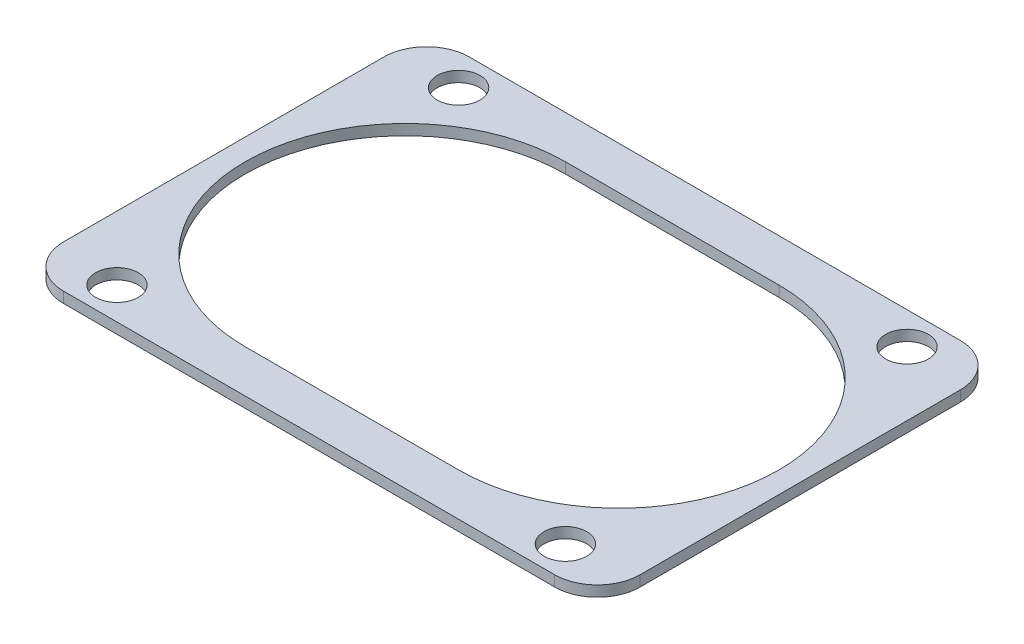
ISO-10303-21;
HEADER;
FILE_DESCRIPTION(('STEP AP214'),'2;1');
FILE_NAME('part.step','',(''),(''),'','','');
FILE_SCHEMA(('AUTOMOTIVE_DESIGN { 1 0 10303 214 1 1 1 1 }'));
ENDSEC;
DATA;
#1=APPLICATION_CONTEXT('core data for automotive mechanical design processes');
#2=APPLICATION_PROTOCOL_DEFINITION('international standard','automotive_design',2000,#1);
#3=PRODUCT_CONTEXT('',#1,'mechanical');
#4=PRODUCT('Part','Part','',(#3));
#5=PRODUCT_RELATED_PRODUCT_CATEGORY('part','',(#4));
#6=PRODUCT_DEFINITION_FORMATION('','',#4);
#7=PRODUCT_DEFINITION_CONTEXT('part definition',#1,'design');
#8=PRODUCT_DEFINITION('design','',#6,#7);
#9=PRODUCT_DEFINITION_SHAPE('','',#8);
#10=(LENGTH_UNIT() NAMED_UNIT(*) SI_UNIT(.MILLI.,.METRE.));
#11=(NAMED_UNIT(*) PLANE_ANGLE_UNIT() SI_UNIT($,.RADIAN.));
#12=(NAMED_UNIT(*) SI_UNIT($,.STERADIAN.) SOLID_ANGLE_UNIT());
#13=UNCERTAINTY_MEASURE_WITH_UNIT(LENGTH_MEASURE(1.E-05),#10,'distance_accuracy_value','');
#14=(GEOMETRIC_REPRESENTATION_CONTEXT(3) GLOBAL_UNCERTAINTY_ASSIGNED_CONTEXT((#13)) GLOBAL_UNIT_ASSIGNED_CONTEXT((#10,
#11,#12)) REPRESENTATION_CONTEXT('',''));
#15=CARTESIAN_POINT('',(0.,0.,0.));
#16=DIRECTION('',(0.,0.,1.));
#17=DIRECTION('',(1.,0.,0.));
#18=AXIS2_PLACEMENT_3D('',#15,#16,#17);
#19=CARTESIAN_POINT('',(0.,1.,0.));
#20=DIRECTION('',(0.,1.,0.));
#21=DIRECTION('',(0.,0.,1.));
#22=AXIS2_PLACEMENT_3D('',#19,#20,#21);
#23=PLANE('',#22);
#24=DIRECTION('',(1.,0.,0.));
#25=VECTOR('',#24,1.);
#26=CARTESIAN_POINT('',(10.,1.,15.));
#27=LINE('',#26,#25);
#28=CARTESIAN_POINT('',(10.,1.,15.));
#29=VERTEX_POINT('',#28);
#30=CARTESIAN_POINT('',(-10.,1.,15.));
#31=VERTEX_POINT('',#30);
#32=EDGE_CURVE('E128',#29,#31,#27,.F.);
#33=ORIENTED_EDGE('',*,*,#32,.T.);
#34=CARTESIAN_POINT('',(-10.,1.,0.));
#35=DIRECTION('',(0.,-1.,0.));
#36=DIRECTION('',(0.,0.,-1.));
#37=AXIS2_PLACEMENT_3D('',#34,#35,#36);
#38=CIRCLE('',#37,15.);
#39=CARTESIAN_POINT('',(-10.,1.,-15.));
#40=VERTEX_POINT('',#39);
#41=EDGE_CURVE('E180',#31,#40,#38,.T.);
#42=ORIENTED_EDGE('',*,*,#41,.T.);
#43=DIRECTION('',(-1.,0.,0.));
#44=VECTOR('',#43,1.);
#45=CARTESIAN_POINT('',(-10.,1.,-15.));
#46=LINE('',#45,#44);
#47=CARTESIAN_POINT('',(10.,1.,-15.));
#48=VERTEX_POINT('',#47);
#49=EDGE_CURVE('E132',#40,#48,#46,.F.);
#50=ORIENTED_EDGE('',*,*,#49,.T.);
#51=CARTESIAN_POINT('',(10.,1.,0.));
#52=DIRECTION('',(0.,-1.,0.));
#53=DIRECTION('',(0.,0.,-1.));
#54=AXIS2_PLACEMENT_3D('',#51,#52,#53);
#55=CIRCLE('',#54,15.);
#56=EDGE_CURVE('E178',#48,#29,#55,.T.);
#57=ORIENTED_EDGE('',*,*,#56,.T.);
#58=EDGE_LOOP('',(#33,#42,#50,#57));
#59=FACE_BOUND('',#58,.T.);
#60=CARTESIAN_POINT('',(-21.,1.,-16.));
#61=DIRECTION('',(0.,-1.,0.));
#62=DIRECTION('',(0.,0.,-1.));
#63=AXIS2_PLACEMENT_3D('',#60,#61,#62);
#64=CIRCLE('',#63,2.);
#65=CARTESIAN_POINT('',(-21.,1.,-18.));
#66=VERTEX_POINT('',#65);
#67=EDGE_CURVE('E182',#66,#66,#64,.T.);
#68=ORIENTED_EDGE('',*,*,#67,.T.);
#69=EDGE_LOOP('',(#68));
#70=FACE_BOUND('',#69,.T.);
#71=CARTESIAN_POINT('',(21.,1.,-16.));
#72=DIRECTION('',(0.,-1.,0.));
#73=DIRECTION('',(0.,0.,-1.));
#74=AXIS2_PLACEMENT_3D('',#71,#72,#73);
#75=CIRCLE('',#74,2.);
#76=CARTESIAN_POINT('',(21.,1.,-18.));
#77=VERTEX_POINT('',#76);
#78=EDGE_CURVE('E185',#77,#77,#75,.T.);
#79=ORIENTED_EDGE('',*,*,#78,.T.);
#80=EDGE_LOOP('',(#79));
#81=FACE_BOUND('',#80,.T.);
#82=CARTESIAN_POINT('',(21.,1.,16.));
#83=DIRECTION('',(0.,-1.,0.));
#84=DIRECTION('',(0.,0.,-1.));
#85=AXIS2_PLACEMENT_3D('',#82,#83,#84);
#86=CIRCLE('',#85,2.);
#87=CARTESIAN_POINT('',(21.,1.,14.));
#88=VERTEX_POINT('',#87);
#89=EDGE_CURVE('E188',#88,#88,#86,.T.);
#90=ORIENTED_EDGE('',*,*,#89,.T.);
#91=EDGE_LOOP('',(#90));
#92=FACE_BOUND('',#91,.T.);
#93=CARTESIAN_POINT('',(-21.,1.,16.));
#94=DIRECTION('',(0.,-1.,0.));
#95=DIRECTION('',(0.,0.,-1.));
#96=AXIS2_PLACEMENT_3D('',#93,#94,#95);
#97=CIRCLE('',#96,2.);
#98=CARTESIAN_POINT('',(-21.,1.,14.));
#99=VERTEX_POINT('',#98);
#100=EDGE_CURVE('E191',#99,#99,#97,.T.);
#101=ORIENTED_EDGE('',*,*,#100,.T.);
#102=EDGE_LOOP('',(#101));
#103=FACE_BOUND('',#102,.T.);
#104=DIRECTION('',(1.,0.,0.));
#105=VECTOR('',#104,1.);
#106=CARTESIAN_POINT('',(-27.,1.,19.));
#107=LINE('',#106,#105);
#108=CARTESIAN_POINT('',(23.,1.,19.));
#109=VERTEX_POINT('',#108);
#110=CARTESIAN_POINT('',(-23.,1.,19.));
#111=VERTEX_POINT('',#110);
#112=EDGE_CURVE('E116',#109,#111,#107,.F.);
#113=ORIENTED_EDGE('',*,*,#112,.F.);
#114=CARTESIAN_POINT('',(23.,1.,15.));
#115=DIRECTION('',(0.,-1.,0.));
#116=DIRECTION('',(0.,0.,-1.));
#117=AXIS2_PLACEMENT_3D('',#114,#115,#116);
#118=CIRCLE('',#117,4.);
#119=CARTESIAN_POINT('',(27.,1.,15.));
#120=VERTEX_POINT('',#119);
#121=EDGE_CURVE('E19',#120,#109,#118,.T.);
#122=ORIENTED_EDGE('',*,*,#121,.F.);
#123=DIRECTION('',(0.,0.,-1.));
#124=VECTOR('',#123,1.);
#125=CARTESIAN_POINT('',(27.,1.,19.));
#126=LINE('',#125,#124);
#127=CARTESIAN_POINT('',(27.,1.,-15.));
#128=VERTEX_POINT('',#127);
#129=EDGE_CURVE('E102',#128,#120,#126,.F.);
#130=ORIENTED_EDGE('',*,*,#129,.F.);
#131=CARTESIAN_POINT('',(23.,1.,-15.));
#132=DIRECTION('',(0.,-1.,0.));
#133=DIRECTION('',(0.,0.,-1.));
#134=AXIS2_PLACEMENT_3D('',#131,#132,#133);
#135=CIRCLE('',#134,4.);
#136=CARTESIAN_POINT('',(23.,1.,-19.));
#137=VERTEX_POINT('',#136);
#138=EDGE_CURVE('E123',#137,#128,#135,.T.);
#139=ORIENTED_EDGE('',*,*,#138,.F.);
#140=DIRECTION('',(-1.,0.,0.));
#141=VECTOR('',#140,1.);
#142=CARTESIAN_POINT('',(27.,1.,-19.));
#143=LINE('',#142,#141);
#144=CARTESIAN_POINT('',(-23.,1.,-19.));
#145=VERTEX_POINT('',#144);
#146=EDGE_CURVE('E143',#145,#137,#143,.F.);
#147=ORIENTED_EDGE('',*,*,#146,.F.);
#148=CARTESIAN_POINT('',(-23.,1.,-15.));
#149=DIRECTION('',(0.,-1.,0.));
#150=DIRECTION('',(0.,0.,-1.));
#151=AXIS2_PLACEMENT_3D('',#148,#149,#150);
#152=CIRCLE('',#151,4.);
#153=CARTESIAN_POINT('',(-27.,1.,-15.));
#154=VERTEX_POINT('',#153);
#155=EDGE_CURVE('E197',#154,#145,#152,.T.);
#156=ORIENTED_EDGE('',*,*,#155,.F.);
#157=DIRECTION('',(0.,0.,1.));
#158=VECTOR('',#157,1.);
#159=CARTESIAN_POINT('',(-27.,1.,-19.));
#160=LINE('',#159,#158);
#161=CARTESIAN_POINT('',(-27.,1.,15.));
#162=VERTEX_POINT('',#161);
#163=EDGE_CURVE('E139',#162,#154,#160,.F.);
#164=ORIENTED_EDGE('',*,*,#163,.F.);
#165=CARTESIAN_POINT('',(-23.,1.,15.));
#166=DIRECTION('',(0.,-1.,0.));
#167=DIRECTION('',(0.,0.,-1.));
#168=AXIS2_PLACEMENT_3D('',#165,#166,#167);
#169=CIRCLE('',#168,4.);
#170=EDGE_CURVE('E195',#111,#162,#169,.T.);
#171=ORIENTED_EDGE('',*,*,#170,.F.);
#172=EDGE_LOOP('',(#113,#122,#130,#139,#147,#156,#164,#171));
#173=FACE_BOUND('',#172,.T.);
#174=ADVANCED_FACE('F16',(#59,#70,#81,#92,#103,#173),#23,.T.);
#175=CARTESIAN_POINT('',(23.,5.9108,15.));
#176=DIRECTION('',(0.,-1.,0.));
#177=DIRECTION('',(0.,0.,-1.));
#178=AXIS2_PLACEMENT_3D('',#175,#176,#177);
#179=CYLINDRICAL_SURFACE('',#178,4.);
#180=DIRECTION('',(0.,1.,0.));
#181=VECTOR('',#180,1.);
#182=CARTESIAN_POINT('',(23.,0.,19.));
#183=LINE('',#182,#181);
#184=CARTESIAN_POINT('',(23.,0.,19.));
#185=VERTEX_POINT('',#184);
#186=EDGE_CURVE('E194',#185,#109,#183,.T.);
#187=ORIENTED_EDGE('',*,*,#186,.F.);
#188=CARTESIAN_POINT('',(23.,0.,15.));
#189=DIRECTION('',(0.,-1.,0.));
#190=DIRECTION('',(0.,0.,-1.));
#191=AXIS2_PLACEMENT_3D('',#188,#189,#190);
#192=CIRCLE('',#191,4.);
#193=CARTESIAN_POINT('',(27.,0.,15.));
#194=VERTEX_POINT('',#193);
#195=EDGE_CURVE('E122',#185,#194,#192,.F.);
#196=ORIENTED_EDGE('',*,*,#195,.T.);
#197=DIRECTION('',(0.,1.,0.));
#198=VECTOR('',#197,1.);
#199=CARTESIAN_POINT('',(27.,0.,15.));
#200=LINE('',#199,#198);
#201=EDGE_CURVE('E107',#120,#194,#200,.F.);
#202=ORIENTED_EDGE('',*,*,#201,.F.);
#203=ORIENTED_EDGE('',*,*,#121,.T.);
#204=EDGE_LOOP('',(#187,#196,#202,#203));
#205=FACE_BOUND('',#204,.T.);
#206=ADVANCED_FACE('F121',(#205),#179,.T.);
#207=CARTESIAN_POINT('',(27.,0.,19.));
#208=DIRECTION('',(1.,0.,0.));
#209=DIRECTION('',(0.,0.,-1.));
#210=AXIS2_PLACEMENT_3D('',#207,#208,#209);
#211=PLANE('',#210);
#212=ORIENTED_EDGE('',*,*,#129,.T.);
#213=ORIENTED_EDGE('',*,*,#201,.T.);
#214=DIRECTION('',(0.,0.,1.));
#215=VECTOR('',#214,1.);
#216=CARTESIAN_POINT('',(27.,0.,0.));
#217=LINE('',#216,#215);
#218=CARTESIAN_POINT('',(27.,0.,-15.));
#219=VERTEX_POINT('',#218);
#220=EDGE_CURVE('E176',#194,#219,#217,.F.);
#221=ORIENTED_EDGE('',*,*,#220,.T.);
#222=DIRECTION('',(0.,-1.,0.));
#223=VECTOR('',#222,1.);
#224=CARTESIAN_POINT('',(27.,5.9108,-15.));
#225=LINE('',#224,#223);
#226=EDGE_CURVE('E109',#128,#219,#225,.T.);
#227=ORIENTED_EDGE('',*,*,#226,.F.);
#228=EDGE_LOOP('',(#212,#213,#221,#227));
#229=FACE_BOUND('',#228,.T.);
#230=ADVANCED_FACE('F104',(#229),#211,.T.);
#231=CARTESIAN_POINT('',(23.,5.9108,-15.));
#232=DIRECTION('',(0.,-1.,0.));
#233=DIRECTION('',(0.,0.,-1.));
#234=AXIS2_PLACEMENT_3D('',#231,#232,#233);
#235=CYLINDRICAL_SURFACE('',#234,4.);
#236=ORIENTED_EDGE('',*,*,#226,.T.);
#237=CARTESIAN_POINT('',(23.,0.,-15.));
#238=DIRECTION('',(0.,-1.,0.));
#239=DIRECTION('',(0.,0.,-1.));
#240=AXIS2_PLACEMENT_3D('',#237,#238,#239);
#241=CIRCLE('',#240,4.);
#242=CARTESIAN_POINT('',(23.,0.,-19.));
#243=VERTEX_POINT('',#242);
#244=EDGE_CURVE('E173',#219,#243,#241,.F.);
#245=ORIENTED_EDGE('',*,*,#244,.T.);
#246=DIRECTION('',(0.,1.,0.));
#247=VECTOR('',#246,1.);
#248=CARTESIAN_POINT('',(23.,0.,-19.));
#249=LINE('',#248,#247);
#250=EDGE_CURVE('E144',#137,#243,#249,.F.);
#251=ORIENTED_EDGE('',*,*,#250,.F.);
#252=ORIENTED_EDGE('',*,*,#138,.T.);
#253=EDGE_LOOP('',(#236,#245,#251,#252));
#254=FACE_BOUND('',#253,.T.);
#255=ADVANCED_FACE('F278',(#254),#235,.T.);
#256=CARTESIAN_POINT('',(27.,0.,-19.));
#257=DIRECTION('',(0.,0.,-1.));
#258=DIRECTION('',(-1.,0.,0.));
#259=AXIS2_PLACEMENT_3D('',#256,#257,#258);
#260=PLANE('',#259);
#261=ORIENTED_EDGE('',*,*,#146,.T.);
#262=ORIENTED_EDGE('',*,*,#250,.T.);
#263=DIRECTION('',(1.,0.,0.));
#264=VECTOR('',#263,1.);
#265=CARTESIAN_POINT('',(0.,0.,-19.));
#266=LINE('',#265,#264);
#267=CARTESIAN_POINT('',(-23.,0.,-19.));
#268=VERTEX_POINT('',#267);
#269=EDGE_CURVE('E172',#243,#268,#266,.F.);
#270=ORIENTED_EDGE('',*,*,#269,.T.);
#271=DIRECTION('',(0.,-1.,0.));
#272=VECTOR('',#271,1.);
#273=CARTESIAN_POINT('',(-23.,5.9108,-19.));
#274=LINE('',#273,#272);
#275=EDGE_CURVE('E142',#145,#268,#274,.T.);
#276=ORIENTED_EDGE('',*,*,#275,.F.);
#277=EDGE_LOOP('',(#261,#262,#270,#276));
#278=FACE_BOUND('',#277,.T.);
#279=ADVANCED_FACE('F276',(#278),#260,.T.);
#280=CARTESIAN_POINT('',(-23.,5.9108,-15.));
#281=DIRECTION('',(0.,-1.,0.));
#282=DIRECTION('',(0.,0.,-1.));
#283=AXIS2_PLACEMENT_3D('',#280,#281,#282);
#284=CYLINDRICAL_SURFACE('',#283,4.);
#285=ORIENTED_EDGE('',*,*,#275,.T.);
#286=CARTESIAN_POINT('',(-23.,0.,-15.));
#287=DIRECTION('',(0.,-1.,0.));
#288=DIRECTION('',(0.,0.,-1.));
#289=AXIS2_PLACEMENT_3D('',#286,#287,#288);
#290=CIRCLE('',#289,4.);
#291=CARTESIAN_POINT('',(-27.,0.,-15.));
#292=VERTEX_POINT('',#291);
#293=EDGE_CURVE('E169',#268,#292,#290,.F.);
#294=ORIENTED_EDGE('',*,*,#293,.T.);
#295=DIRECTION('',(0.,1.,0.));
#296=VECTOR('',#295,1.);
#297=CARTESIAN_POINT('',(-27.,0.,-15.));
#298=LINE('',#297,#296);
#299=EDGE_CURVE('E141',#154,#292,#298,.F.);
#300=ORIENTED_EDGE('',*,*,#299,.F.);
#301=ORIENTED_EDGE('',*,*,#155,.T.);
#302=EDGE_LOOP('',(#285,#294,#300,#301));
#303=FACE_BOUND('',#302,.T.);
#304=ADVANCED_FACE('F273',(#303),#284,.T.);
#305=CARTESIAN_POINT('',(-27.,0.,-19.));
#306=DIRECTION('',(-1.,0.,0.));
#307=DIRECTION('',(0.,0.,1.));
#308=AXIS2_PLACEMENT_3D('',#305,#306,#307);
#309=PLANE('',#308);
#310=ORIENTED_EDGE('',*,*,#163,.T.);
#311=ORIENTED_EDGE('',*,*,#299,.T.);
#312=DIRECTION('',(0.,0.,1.));
#313=VECTOR('',#312,1.);
#314=CARTESIAN_POINT('',(-27.,0.,0.));
#315=LINE('',#314,#313);
#316=CARTESIAN_POINT('',(-27.,0.,15.));
#317=VERTEX_POINT('',#316);
#318=EDGE_CURVE('E168',#292,#317,#315,.T.);
#319=ORIENTED_EDGE('',*,*,#318,.T.);
#320=DIRECTION('',(0.,-1.,0.));
#321=VECTOR('',#320,1.);
#322=CARTESIAN_POINT('',(-27.,5.9108,15.));
#323=LINE('',#322,#321);
#324=EDGE_CURVE('E138',#162,#317,#323,.T.);
#325=ORIENTED_EDGE('',*,*,#324,.F.);
#326=EDGE_LOOP('',(#310,#311,#319,#325));
#327=FACE_BOUND('',#326,.T.);
#328=ADVANCED_FACE('F271',(#327),#309,.T.);
#329=CARTESIAN_POINT('',(-23.,5.9108,15.));
#330=DIRECTION('',(0.,-1.,0.));
#331=DIRECTION('',(0.,0.,-1.));
#332=AXIS2_PLACEMENT_3D('',#329,#330,#331);
#333=CYLINDRICAL_SURFACE('',#332,4.);
#334=ORIENTED_EDGE('',*,*,#324,.T.);
#335=CARTESIAN_POINT('',(-23.,0.,15.));
#336=DIRECTION('',(0.,-1.,0.));
#337=DIRECTION('',(0.,0.,-1.));
#338=AXIS2_PLACEMENT_3D('',#335,#336,#337);
#339=CIRCLE('',#338,4.);
#340=CARTESIAN_POINT('',(-23.,0.,19.));
#341=VERTEX_POINT('',#340);
#342=EDGE_CURVE('E165',#317,#341,#339,.F.);
#343=ORIENTED_EDGE('',*,*,#342,.T.);
#344=DIRECTION('',(0.,1.,0.));
#345=VECTOR('',#344,1.);
#346=CARTESIAN_POINT('',(-23.,0.,19.));
#347=LINE('',#346,#345);
#348=EDGE_CURVE('E137',#111,#341,#347,.F.);
#349=ORIENTED_EDGE('',*,*,#348,.F.);
#350=ORIENTED_EDGE('',*,*,#170,.T.);
#351=EDGE_LOOP('',(#334,#343,#349,#350));
#352=FACE_BOUND('',#351,.T.);
#353=ADVANCED_FACE('F280',(#352),#333,.T.);
#354=CARTESIAN_POINT('',(-27.,0.,19.));
#355=DIRECTION('',(0.,0.,1.));
#356=DIRECTION('',(1.,0.,0.));
#357=AXIS2_PLACEMENT_3D('',#354,#355,#356);
#358=PLANE('',#357);
#359=DIRECTION('',(1.,0.,0.));
#360=VECTOR('',#359,1.);
#361=CARTESIAN_POINT('',(0.,0.,19.));
#362=LINE('',#361,#360);
#363=EDGE_CURVE('E164',#341,#185,#362,.T.);
#364=ORIENTED_EDGE('',*,*,#363,.T.);
#365=ORIENTED_EDGE('',*,*,#186,.T.);
#366=ORIENTED_EDGE('',*,*,#112,.T.);
#367=ORIENTED_EDGE('',*,*,#348,.T.);
#368=EDGE_LOOP('',(#364,#365,#366,#367));
#369=FACE_BOUND('',#368,.T.);
#370=ADVANCED_FACE('F256',(#369),#358,.T.);
#371=CARTESIAN_POINT('',(-21.,0.,16.));
#372=DIRECTION('',(0.,-1.,0.));
#373=DIRECTION('',(0.,0.,-1.));
#374=AXIS2_PLACEMENT_3D('',#371,#372,#373);
#375=CYLINDRICAL_SURFACE('',#374,2.);
#376=ORIENTED_EDGE('',*,*,#100,.F.);
#377=EDGE_LOOP('',(#376));
#378=FACE_BOUND('',#377,.T.);
#379=CARTESIAN_POINT('',(-21.,0.,16.));
#380=DIRECTION('',(0.,-1.,0.));
#381=DIRECTION('',(0.,0.,-1.));
#382=AXIS2_PLACEMENT_3D('',#379,#380,#381);
#383=CIRCLE('',#382,2.);
#384=CARTESIAN_POINT('',(-21.,0.,14.));
#385=VERTEX_POINT('',#384);
#386=EDGE_CURVE('E161',#385,#385,#383,.T.);
#387=ORIENTED_EDGE('',*,*,#386,.T.);
#388=EDGE_LOOP('',(#387));
#389=FACE_BOUND('',#388,.T.);
#390=ADVANCED_FACE('F252',(#378,#389),#375,.F.);
#391=CARTESIAN_POINT('',(21.,0.,16.));
#392=DIRECTION('',(0.,-1.,0.));
#393=DIRECTION('',(0.,0.,-1.));
#394=AXIS2_PLACEMENT_3D('',#391,#392,#393);
#395=CYLINDRICAL_SURFACE('',#394,2.);
#396=ORIENTED_EDGE('',*,*,#89,.F.);
#397=EDGE_LOOP('',(#396));
#398=FACE_BOUND('',#397,.T.);
#399=CARTESIAN_POINT('',(21.,0.,16.));
#400=DIRECTION('',(0.,-1.,0.));
#401=DIRECTION('',(0.,0.,-1.));
#402=AXIS2_PLACEMENT_3D('',#399,#400,#401);
#403=CIRCLE('',#402,2.);
#404=CARTESIAN_POINT('',(21.,0.,14.));
#405=VERTEX_POINT('',#404);
#406=EDGE_CURVE('E158',#405,#405,#403,.T.);
#407=ORIENTED_EDGE('',*,*,#406,.T.);
#408=EDGE_LOOP('',(#407));
#409=FACE_BOUND('',#408,.T.);
#410=ADVANCED_FACE('F255',(#398,#409),#395,.F.);
#411=CARTESIAN_POINT('',(21.,0.,-16.));
#412=DIRECTION('',(0.,-1.,0.));
#413=DIRECTION('',(0.,0.,-1.));
#414=AXIS2_PLACEMENT_3D('',#411,#412,#413);
#415=CYLINDRICAL_SURFACE('',#414,2.);
#416=ORIENTED_EDGE('',*,*,#78,.F.);
#417=EDGE_LOOP('',(#416));
#418=FACE_BOUND('',#417,.T.);
#419=CARTESIAN_POINT('',(21.,0.,-16.));
#420=DIRECTION('',(0.,-1.,0.));
#421=DIRECTION('',(0.,0.,-1.));
#422=AXIS2_PLACEMENT_3D('',#419,#420,#421);
#423=CIRCLE('',#422,2.);
#424=CARTESIAN_POINT('',(21.,0.,-18.));
#425=VERTEX_POINT('',#424);
#426=EDGE_CURVE('E155',#425,#425,#423,.T.);
#427=ORIENTED_EDGE('',*,*,#426,.T.);
#428=EDGE_LOOP('',(#427));
#429=FACE_BOUND('',#428,.T.);
#430=ADVANCED_FACE('F353',(#418,#429),#415,.F.);
#431=CARTESIAN_POINT('',(-21.,0.,-16.));
#432=DIRECTION('',(0.,-1.,0.));
#433=DIRECTION('',(0.,0.,-1.));
#434=AXIS2_PLACEMENT_3D('',#431,#432,#433);
#435=CYLINDRICAL_SURFACE('',#434,2.);
#436=ORIENTED_EDGE('',*,*,#67,.F.);
#437=EDGE_LOOP('',(#436));
#438=FACE_BOUND('',#437,.T.);
#439=CARTESIAN_POINT('',(-21.,0.,-16.));
#440=DIRECTION('',(0.,-1.,0.));
#441=DIRECTION('',(0.,0.,-1.));
#442=AXIS2_PLACEMENT_3D('',#439,#440,#441);
#443=CIRCLE('',#442,2.);
#444=CARTESIAN_POINT('',(-21.,0.,-18.));
#445=VERTEX_POINT('',#444);
#446=EDGE_CURVE('E152',#445,#445,#443,.T.);
#447=ORIENTED_EDGE('',*,*,#446,.T.);
#448=EDGE_LOOP('',(#447));
#449=FACE_BOUND('',#448,.T.);
#450=ADVANCED_FACE('F363',(#438,#449),#435,.F.);
#451=CARTESIAN_POINT('',(-10.,0.,0.));
#452=DIRECTION('',(0.,-1.,0.));
#453=DIRECTION('',(0.,0.,-1.));
#454=AXIS2_PLACEMENT_3D('',#451,#452,#453);
#455=CYLINDRICAL_SURFACE('',#454,15.);
#456=ORIENTED_EDGE('',*,*,#41,.F.);
#457=DIRECTION('',(0.,1.,0.));
#458=VECTOR('',#457,1.);
#459=CARTESIAN_POINT('',(-10.,0.,15.));
#460=LINE('',#459,#458);
#461=CARTESIAN_POINT('',(-10.,0.,15.));
#462=VERTEX_POINT('',#461);
#463=EDGE_CURVE('E131',#31,#462,#460,.F.);
#464=ORIENTED_EDGE('',*,*,#463,.T.);
#465=CARTESIAN_POINT('',(-10.,0.,0.));
#466=DIRECTION('',(0.,-1.,0.));
#467=DIRECTION('',(0.,0.,-1.));
#468=AXIS2_PLACEMENT_3D('',#465,#466,#467);
#469=CIRCLE('',#468,15.);
#470=CARTESIAN_POINT('',(-10.,0.,-15.));
#471=VERTEX_POINT('',#470);
#472=EDGE_CURVE('E149',#462,#471,#469,.T.);
#473=ORIENTED_EDGE('',*,*,#472,.T.);
#474=DIRECTION('',(0.,1.,0.));
#475=VECTOR('',#474,1.);
#476=CARTESIAN_POINT('',(-10.,0.,-15.));
#477=LINE('',#476,#475);
#478=EDGE_CURVE('E135',#471,#40,#477,.T.);
#479=ORIENTED_EDGE('',*,*,#478,.T.);
#480=EDGE_LOOP('',(#456,#464,#473,#479));
#481=FACE_BOUND('',#480,.T.);
#482=ADVANCED_FACE('F235',(#481),#455,.F.);
#483=CARTESIAN_POINT('',(-10.,0.,-15.));
#484=DIRECTION('',(0.,0.,-1.));
#485=DIRECTION('',(-1.,0.,0.));
#486=AXIS2_PLACEMENT_3D('',#483,#484,#485);
#487=PLANE('',#486);
#488=ORIENTED_EDGE('',*,*,#49,.F.);
#489=ORIENTED_EDGE('',*,*,#478,.F.);
#490=DIRECTION('',(1.,0.,0.));
#491=VECTOR('',#490,1.);
#492=CARTESIAN_POINT('',(0.,0.,-15.));
#493=LINE('',#492,#491);
#494=CARTESIAN_POINT('',(10.,0.,-15.));
#495=VERTEX_POINT('',#494);
#496=EDGE_CURVE('E148',#471,#495,#493,.T.);
#497=ORIENTED_EDGE('',*,*,#496,.T.);
#498=DIRECTION('',(0.,-1.,0.));
#499=VECTOR('',#498,1.);
#500=CARTESIAN_POINT('',(10.,0.,-15.));
#501=LINE('',#500,#499);
#502=EDGE_CURVE('E134',#495,#48,#501,.F.);
#503=ORIENTED_EDGE('',*,*,#502,.T.);
#504=EDGE_LOOP('',(#488,#489,#497,#503));
#505=FACE_BOUND('',#504,.T.);
#506=ADVANCED_FACE('F229',(#505),#487,.F.);
#507=CARTESIAN_POINT('',(10.,0.,0.));
#508=DIRECTION('',(0.,-1.,0.));
#509=DIRECTION('',(0.,0.,-1.));
#510=AXIS2_PLACEMENT_3D('',#507,#508,#509);
#511=CYLINDRICAL_SURFACE('',#510,15.);
#512=ORIENTED_EDGE('',*,*,#56,.F.);
#513=ORIENTED_EDGE('',*,*,#502,.F.);
#514=CARTESIAN_POINT('',(10.,0.,0.));
#515=DIRECTION('',(0.,-1.,0.));
#516=DIRECTION('',(0.,0.,-1.));
#517=AXIS2_PLACEMENT_3D('',#514,#515,#516);
#518=CIRCLE('',#517,15.);
#519=CARTESIAN_POINT('',(10.,0.,15.));
#520=VERTEX_POINT('',#519);
#521=EDGE_CURVE('E25',#495,#520,#518,.T.);
#522=ORIENTED_EDGE('',*,*,#521,.T.);
#523=DIRECTION('',(0.,1.,0.));
#524=VECTOR('',#523,1.);
#525=CARTESIAN_POINT('',(10.,0.,15.));
#526=LINE('',#525,#524);
#527=EDGE_CURVE('E33',#520,#29,#526,.T.);
#528=ORIENTED_EDGE('',*,*,#527,.T.);
#529=EDGE_LOOP('',(#512,#513,#522,#528));
#530=FACE_BOUND('',#529,.T.);
#531=ADVANCED_FACE('F240',(#530),#511,.F.);
#532=CARTESIAN_POINT('',(10.,0.,15.));
#533=DIRECTION('',(0.,0.,1.));
#534=DIRECTION('',(1.,0.,0.));
#535=AXIS2_PLACEMENT_3D('',#532,#533,#534);
#536=PLANE('',#535);
#537=ORIENTED_EDGE('',*,*,#32,.F.);
#538=ORIENTED_EDGE('',*,*,#527,.F.);
#539=DIRECTION('',(1.,0.,0.));
#540=VECTOR('',#539,1.);
#541=CARTESIAN_POINT('',(0.,0.,15.));
#542=LINE('',#541,#540);
#543=EDGE_CURVE('E11',#520,#462,#542,.F.);
#544=ORIENTED_EDGE('',*,*,#543,.T.);
#545=ORIENTED_EDGE('',*,*,#463,.F.);
#546=EDGE_LOOP('',(#537,#538,#544,#545));
#547=FACE_BOUND('',#546,.T.);
#548=ADVANCED_FACE('F237',(#547),#536,.F.);
#549=CARTESIAN_POINT('',(0.,0.,0.));
#550=DIRECTION('',(0.,1.,0.));
#551=DIRECTION('',(0.,0.,1.));
#552=AXIS2_PLACEMENT_3D('',#549,#550,#551);
#553=PLANE('',#552);
#554=ORIENTED_EDGE('',*,*,#521,.F.);
#555=ORIENTED_EDGE('',*,*,#496,.F.);
#556=ORIENTED_EDGE('',*,*,#472,.F.);
#557=ORIENTED_EDGE('',*,*,#543,.F.);
#558=EDGE_LOOP('',(#554,#555,#556,#557));
#559=FACE_BOUND('',#558,.T.);
#560=ORIENTED_EDGE('',*,*,#446,.F.);
#561=EDGE_LOOP('',(#560));
#562=FACE_BOUND('',#561,.T.);
#563=ORIENTED_EDGE('',*,*,#426,.F.);
#564=EDGE_LOOP('',(#563));
#565=FACE_BOUND('',#564,.T.);
#566=ORIENTED_EDGE('',*,*,#406,.F.);
#567=EDGE_LOOP('',(#566));
#568=FACE_BOUND('',#567,.T.);
#569=ORIENTED_EDGE('',*,*,#386,.F.);
#570=EDGE_LOOP('',(#569));
#571=FACE_BOUND('',#570,.T.);
#572=ORIENTED_EDGE('',*,*,#342,.F.);
#573=ORIENTED_EDGE('',*,*,#318,.F.);
#574=ORIENTED_EDGE('',*,*,#293,.F.);
#575=ORIENTED_EDGE('',*,*,#269,.F.);
#576=ORIENTED_EDGE('',*,*,#244,.F.);
#577=ORIENTED_EDGE('',*,*,#220,.F.);
#578=ORIENTED_EDGE('',*,*,#195,.F.);
#579=ORIENTED_EDGE('',*,*,#363,.F.);
#580=EDGE_LOOP('',(#572,#573,#574,#575,#576,#577,#578,#579));
#581=FACE_BOUND('',#580,.T.);
#582=ADVANCED_FACE('F232',(#559,#562,#565,#568,#571,#581),#553,.F.);
#583=CLOSED_SHELL('',(#174,#206,#230,#255,#279,#304,#328,#353,#370,#390,#410,#430,#450,#482,
#506,#531,#548,#582));
#584=MANIFOLD_SOLID_BREP('B1',#583);
#585=ADVANCED_BREP_SHAPE_REPRESENTATION('',(#18,#584),#14);
#586=SHAPE_DEFINITION_REPRESENTATION(#9,#585);
ENDSEC;
END-ISO-10303-21;
